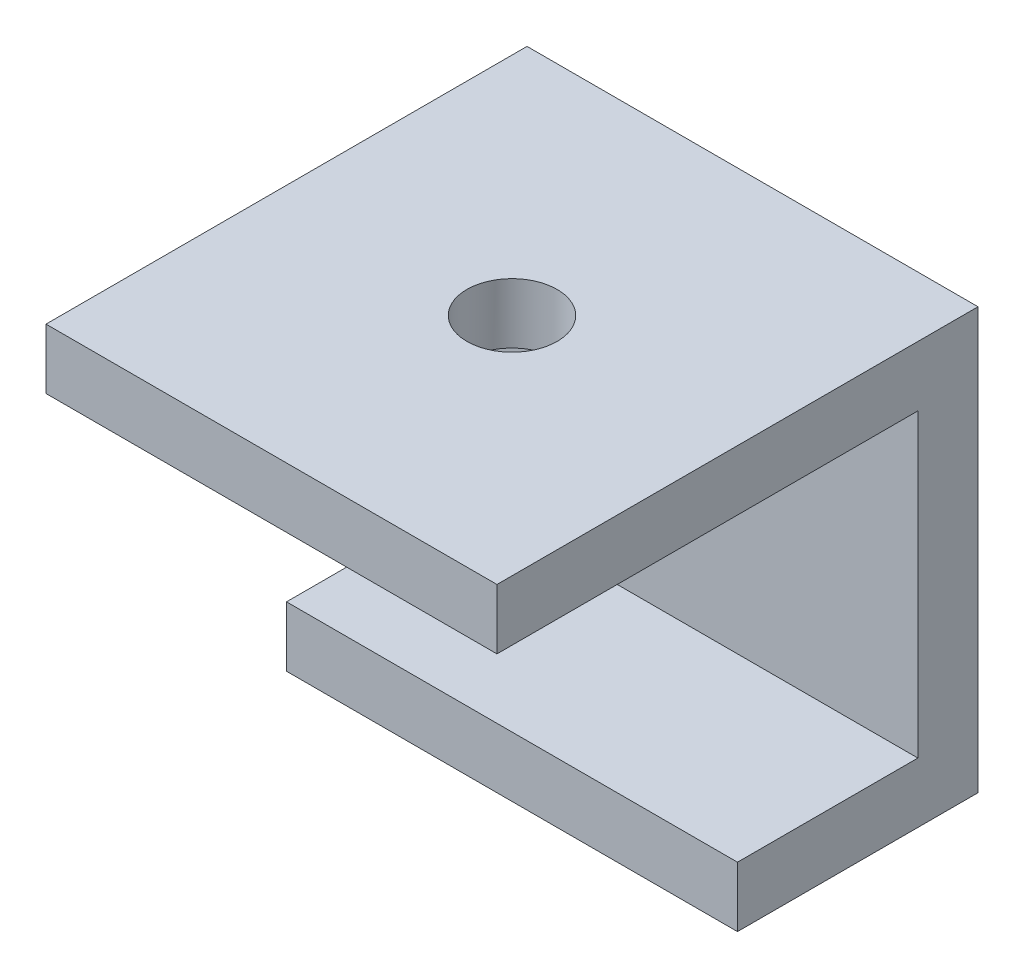
ISO-10303-21;
HEADER;
FILE_DESCRIPTION(('STEP AP214'),'2;1');
FILE_NAME('part.step','',(''),(''),'','','');
FILE_SCHEMA(('AUTOMOTIVE_DESIGN { 1 0 10303 214 1 1 1 1 }'));
ENDSEC;
DATA;
#1=APPLICATION_CONTEXT('core data for automotive mechanical design processes');
#2=APPLICATION_PROTOCOL_DEFINITION('international standard','automotive_design',2000,#1);
#3=PRODUCT_CONTEXT('',#1,'mechanical');
#4=PRODUCT('Part','Part','',(#3));
#5=PRODUCT_RELATED_PRODUCT_CATEGORY('part','',(#4));
#6=PRODUCT_DEFINITION_FORMATION('','',#4);
#7=PRODUCT_DEFINITION_CONTEXT('part definition',#1,'design');
#8=PRODUCT_DEFINITION('design','',#6,#7);
#9=PRODUCT_DEFINITION_SHAPE('','',#8);
#10=(LENGTH_UNIT() NAMED_UNIT(*) SI_UNIT(.MILLI.,.METRE.));
#11=(NAMED_UNIT(*) PLANE_ANGLE_UNIT() SI_UNIT($,.RADIAN.));
#12=(NAMED_UNIT(*) SI_UNIT($,.STERADIAN.) SOLID_ANGLE_UNIT());
#13=UNCERTAINTY_MEASURE_WITH_UNIT(LENGTH_MEASURE(1.E-05),#10,'distance_accuracy_value','');
#14=(GEOMETRIC_REPRESENTATION_CONTEXT(3) GLOBAL_UNCERTAINTY_ASSIGNED_CONTEXT((#13)) GLOBAL_UNIT_ASSIGNED_CONTEXT((#10,
#11,#12)) REPRESENTATION_CONTEXT('',''));
#15=CARTESIAN_POINT('',(0.,0.,0.));
#16=DIRECTION('',(0.,0.,1.));
#17=DIRECTION('',(1.,0.,0.));
#18=AXIS2_PLACEMENT_3D('',#15,#16,#17);
#19=CARTESIAN_POINT('',(-15.,0.,16.));
#20=DIRECTION('',(0.,1.,0.));
#21=DIRECTION('',(0.,0.,1.));
#22=AXIS2_PLACEMENT_3D('',#19,#20,#21);
#23=PLANE('',#22);
#24=CARTESIAN_POINT('',(-7.5,0.,8.));
#25=DIRECTION('',(0.,1.,0.));
#26=DIRECTION('',(0.,0.,1.));
#27=AXIS2_PLACEMENT_3D('',#24,#25,#26);
#28=CIRCLE('',#27,1.5);
#29=CARTESIAN_POINT('',(-7.5,0.,9.5));
#30=VERTEX_POINT('',#29);
#31=EDGE_CURVE('E134',#30,#30,#28,.T.);
#32=ORIENTED_EDGE('',*,*,#31,.F.);
#33=EDGE_LOOP('',(#32));
#34=FACE_BOUND('',#33,.T.);
#35=DIRECTION('',(0.,0.,1.));
#36=VECTOR('',#35,1.);
#37=CARTESIAN_POINT('',(0.,0.,16.));
#38=LINE('',#37,#36);
#39=CARTESIAN_POINT('',(0.,0.,0.));
#40=VERTEX_POINT('',#39);
#41=CARTESIAN_POINT('',(0.,0.,16.));
#42=VERTEX_POINT('',#41);
#43=EDGE_CURVE('E130',#40,#42,#38,.T.);
#44=ORIENTED_EDGE('',*,*,#43,.F.);
#45=DIRECTION('',(1.,0.,0.));
#46=VECTOR('',#45,1.);
#47=CARTESIAN_POINT('',(-15.,0.,0.));
#48=LINE('',#47,#46);
#49=CARTESIAN_POINT('',(-15.,0.,0.));
#50=VERTEX_POINT('',#49);
#51=EDGE_CURVE('E11',#50,#40,#48,.T.);
#52=ORIENTED_EDGE('',*,*,#51,.F.);
#53=DIRECTION('',(0.,0.,1.));
#54=VECTOR('',#53,1.);
#55=CARTESIAN_POINT('',(-15.,0.,16.));
#56=LINE('',#55,#54);
#57=CARTESIAN_POINT('',(-15.,0.,16.));
#58=VERTEX_POINT('',#57);
#59=EDGE_CURVE('E151',#50,#58,#56,.T.);
#60=ORIENTED_EDGE('',*,*,#59,.T.);
#61=DIRECTION('',(1.,0.,0.));
#62=VECTOR('',#61,1.);
#63=CARTESIAN_POINT('',(-15.,0.,16.));
#64=LINE('',#63,#62);
#65=EDGE_CURVE('E36',#58,#42,#64,.T.);
#66=ORIENTED_EDGE('',*,*,#65,.T.);
#67=EDGE_LOOP('',(#44,#52,#60,#66));
#68=FACE_BOUND('',#67,.T.);
#69=ADVANCED_FACE('F33',(#34,#68),#23,.T.);
#70=CARTESIAN_POINT('',(-15.,0.,0.));
#71=DIRECTION('',(0.,0.,-1.));
#72=DIRECTION('',(0.,1.,0.));
#73=AXIS2_PLACEMENT_3D('',#70,#71,#72);
#74=PLANE('',#73);
#75=DIRECTION('',(0.,1.,0.));
#76=VECTOR('',#75,1.);
#77=CARTESIAN_POINT('',(0.,0.,0.));
#78=LINE('',#77,#76);
#79=CARTESIAN_POINT('',(0.,-14.,0.));
#80=VERTEX_POINT('',#79);
#81=EDGE_CURVE('E149',#80,#40,#78,.T.);
#82=ORIENTED_EDGE('',*,*,#81,.F.);
#83=DIRECTION('',(1.,0.,0.));
#84=VECTOR('',#83,1.);
#85=CARTESIAN_POINT('',(-15.,-14.,0.));
#86=LINE('',#85,#84);
#87=CARTESIAN_POINT('',(-15.,-14.,0.));
#88=VERTEX_POINT('',#87);
#89=EDGE_CURVE('E42',#88,#80,#86,.T.);
#90=ORIENTED_EDGE('',*,*,#89,.F.);
#91=DIRECTION('',(0.,1.,0.));
#92=VECTOR('',#91,1.);
#93=CARTESIAN_POINT('',(-15.,0.,0.));
#94=LINE('',#93,#92);
#95=EDGE_CURVE('E120',#88,#50,#94,.T.);
#96=ORIENTED_EDGE('',*,*,#95,.T.);
#97=ORIENTED_EDGE('',*,*,#51,.T.);
#98=EDGE_LOOP('',(#82,#90,#96,#97));
#99=FACE_BOUND('',#98,.T.);
#100=ADVANCED_FACE('F163',(#99),#74,.T.);
#101=CARTESIAN_POINT('',(-15.,-14.,0.));
#102=DIRECTION('',(0.,-1.,0.));
#103=DIRECTION('',(0.,0.,-1.));
#104=AXIS2_PLACEMENT_3D('',#101,#102,#103);
#105=PLANE('',#104);
#106=DIRECTION('',(0.,0.,-1.));
#107=VECTOR('',#106,1.);
#108=CARTESIAN_POINT('',(0.,-14.,0.));
#109=LINE('',#108,#107);
#110=CARTESIAN_POINT('',(0.,-14.,8.));
#111=VERTEX_POINT('',#110);
#112=EDGE_CURVE('E107',#111,#80,#109,.T.);
#113=ORIENTED_EDGE('',*,*,#112,.F.);
#114=DIRECTION('',(1.,0.,0.));
#115=VECTOR('',#114,1.);
#116=CARTESIAN_POINT('',(-15.,-14.,8.));
#117=LINE('',#116,#115);
#118=CARTESIAN_POINT('',(-15.,-14.,8.));
#119=VERTEX_POINT('',#118);
#120=EDGE_CURVE('E102',#119,#111,#117,.T.);
#121=ORIENTED_EDGE('',*,*,#120,.F.);
#122=DIRECTION('',(0.,0.,-1.));
#123=VECTOR('',#122,1.);
#124=CARTESIAN_POINT('',(-15.,-14.,0.));
#125=LINE('',#124,#123);
#126=EDGE_CURVE('E105',#119,#88,#125,.T.);
#127=ORIENTED_EDGE('',*,*,#126,.T.);
#128=ORIENTED_EDGE('',*,*,#89,.T.);
#129=EDGE_LOOP('',(#113,#121,#127,#128));
#130=FACE_BOUND('',#129,.T.);
#131=ADVANCED_FACE('F104',(#130),#105,.T.);
#132=CARTESIAN_POINT('',(-15.,-14.,8.));
#133=DIRECTION('',(0.,0.,1.));
#134=DIRECTION('',(1.,0.,0.));
#135=AXIS2_PLACEMENT_3D('',#132,#133,#134);
#136=PLANE('',#135);
#137=DIRECTION('',(0.,-1.,0.));
#138=VECTOR('',#137,1.);
#139=CARTESIAN_POINT('',(0.,-14.,8.));
#140=LINE('',#139,#138);
#141=CARTESIAN_POINT('',(0.,-12.,8.));
#142=VERTEX_POINT('',#141);
#143=EDGE_CURVE('E146',#142,#111,#140,.T.);
#144=ORIENTED_EDGE('',*,*,#143,.F.);
#145=DIRECTION('',(1.,0.,0.));
#146=VECTOR('',#145,1.);
#147=CARTESIAN_POINT('',(-15.,-12.,8.));
#148=LINE('',#147,#146);
#149=CARTESIAN_POINT('',(-15.,-12.,8.));
#150=VERTEX_POINT('',#149);
#151=EDGE_CURVE('E112',#150,#142,#148,.T.);
#152=ORIENTED_EDGE('',*,*,#151,.F.);
#153=DIRECTION('',(0.,-1.,0.));
#154=VECTOR('',#153,1.);
#155=CARTESIAN_POINT('',(-15.,-14.,8.));
#156=LINE('',#155,#154);
#157=EDGE_CURVE('E118',#150,#119,#156,.T.);
#158=ORIENTED_EDGE('',*,*,#157,.T.);
#159=ORIENTED_EDGE('',*,*,#120,.T.);
#160=EDGE_LOOP('',(#144,#152,#158,#159));
#161=FACE_BOUND('',#160,.T.);
#162=ADVANCED_FACE('F122',(#161),#136,.T.);
#163=CARTESIAN_POINT('',(-15.,-12.,8.));
#164=DIRECTION('',(0.,1.,0.));
#165=DIRECTION('',(0.,0.,1.));
#166=AXIS2_PLACEMENT_3D('',#163,#164,#165);
#167=PLANE('',#166);
#168=DIRECTION('',(0.,0.,1.));
#169=VECTOR('',#168,1.);
#170=CARTESIAN_POINT('',(0.,-12.,8.));
#171=LINE('',#170,#169);
#172=CARTESIAN_POINT('',(0.,-12.,2.));
#173=VERTEX_POINT('',#172);
#174=EDGE_CURVE('E143',#173,#142,#171,.T.);
#175=ORIENTED_EDGE('',*,*,#174,.F.);
#176=DIRECTION('',(1.,0.,0.));
#177=VECTOR('',#176,1.);
#178=CARTESIAN_POINT('',(-15.,-12.,2.));
#179=LINE('',#178,#177);
#180=CARTESIAN_POINT('',(-15.,-12.,2.));
#181=VERTEX_POINT('',#180);
#182=EDGE_CURVE('E155',#181,#173,#179,.T.);
#183=ORIENTED_EDGE('',*,*,#182,.F.);
#184=DIRECTION('',(0.,0.,1.));
#185=VECTOR('',#184,1.);
#186=CARTESIAN_POINT('',(-15.,-12.,8.));
#187=LINE('',#186,#185);
#188=EDGE_CURVE('E123',#181,#150,#187,.T.);
#189=ORIENTED_EDGE('',*,*,#188,.T.);
#190=ORIENTED_EDGE('',*,*,#151,.T.);
#191=EDGE_LOOP('',(#175,#183,#189,#190));
#192=FACE_BOUND('',#191,.T.);
#193=ADVANCED_FACE('F177',(#192),#167,.T.);
#194=CARTESIAN_POINT('',(-15.,-12.,2.));
#195=DIRECTION('',(0.,0.,1.));
#196=DIRECTION('',(0.,-1.,0.));
#197=AXIS2_PLACEMENT_3D('',#194,#195,#196);
#198=PLANE('',#197);
#199=DIRECTION('',(0.,-1.,0.));
#200=VECTOR('',#199,1.);
#201=CARTESIAN_POINT('',(0.,-12.,2.));
#202=LINE('',#201,#200);
#203=CARTESIAN_POINT('',(0.,-2.,2.));
#204=VERTEX_POINT('',#203);
#205=EDGE_CURVE('E140',#204,#173,#202,.T.);
#206=ORIENTED_EDGE('',*,*,#205,.F.);
#207=DIRECTION('',(1.,0.,0.));
#208=VECTOR('',#207,1.);
#209=CARTESIAN_POINT('',(-15.,-2.,2.));
#210=LINE('',#209,#208);
#211=CARTESIAN_POINT('',(-15.,-2.,2.));
#212=VERTEX_POINT('',#211);
#213=EDGE_CURVE('E157',#212,#204,#210,.T.);
#214=ORIENTED_EDGE('',*,*,#213,.F.);
#215=DIRECTION('',(0.,-1.,0.));
#216=VECTOR('',#215,1.);
#217=CARTESIAN_POINT('',(-15.,-12.,2.));
#218=LINE('',#217,#216);
#219=EDGE_CURVE('E125',#212,#181,#218,.T.);
#220=ORIENTED_EDGE('',*,*,#219,.T.);
#221=ORIENTED_EDGE('',*,*,#182,.T.);
#222=EDGE_LOOP('',(#206,#214,#220,#221));
#223=FACE_BOUND('',#222,.T.);
#224=ADVANCED_FACE('F180',(#223),#198,.T.);
#225=CARTESIAN_POINT('',(-15.,-2.,2.));
#226=DIRECTION('',(0.,-1.,0.));
#227=DIRECTION('',(0.,0.,-1.));
#228=AXIS2_PLACEMENT_3D('',#225,#226,#227);
#229=PLANE('',#228);
#230=CARTESIAN_POINT('',(-7.5,-2.,8.));
#231=DIRECTION('',(0.,-1.,0.));
#232=DIRECTION('',(0.,0.,-1.));
#233=AXIS2_PLACEMENT_3D('',#230,#231,#232);
#234=CIRCLE('',#233,1.5);
#235=CARTESIAN_POINT('',(-7.5,-2.,6.5));
#236=VERTEX_POINT('',#235);
#237=EDGE_CURVE('E204',#236,#236,#234,.F.);
#238=ORIENTED_EDGE('',*,*,#237,.T.);
#239=EDGE_LOOP('',(#238));
#240=FACE_BOUND('',#239,.T.);
#241=DIRECTION('',(0.,0.,-1.));
#242=VECTOR('',#241,1.);
#243=CARTESIAN_POINT('',(0.,-2.,2.));
#244=LINE('',#243,#242);
#245=CARTESIAN_POINT('',(0.,-2.,16.));
#246=VERTEX_POINT('',#245);
#247=EDGE_CURVE('E137',#246,#204,#244,.T.);
#248=ORIENTED_EDGE('',*,*,#247,.F.);
#249=DIRECTION('',(1.,0.,0.));
#250=VECTOR('',#249,1.);
#251=CARTESIAN_POINT('',(-15.,-2.,16.));
#252=LINE('',#251,#250);
#253=CARTESIAN_POINT('',(-15.,-2.,16.));
#254=VERTEX_POINT('',#253);
#255=EDGE_CURVE('E158',#254,#246,#252,.T.);
#256=ORIENTED_EDGE('',*,*,#255,.F.);
#257=DIRECTION('',(0.,0.,-1.));
#258=VECTOR('',#257,1.);
#259=CARTESIAN_POINT('',(-15.,-2.,2.));
#260=LINE('',#259,#258);
#261=EDGE_CURVE('E213',#254,#212,#260,.T.);
#262=ORIENTED_EDGE('',*,*,#261,.T.);
#263=ORIENTED_EDGE('',*,*,#213,.T.);
#264=EDGE_LOOP('',(#248,#256,#262,#263));
#265=FACE_BOUND('',#264,.T.);
#266=ADVANCED_FACE('F184',(#240,#265),#229,.T.);
#267=CARTESIAN_POINT('',(-15.,-2.,16.));
#268=DIRECTION('',(0.,0.,1.));
#269=DIRECTION('',(1.,0.,0.));
#270=AXIS2_PLACEMENT_3D('',#267,#268,#269);
#271=PLANE('',#270);
#272=DIRECTION('',(0.,-1.,0.));
#273=VECTOR('',#272,1.);
#274=CARTESIAN_POINT('',(0.,-2.,16.));
#275=LINE('',#274,#273);
#276=EDGE_CURVE('E133',#42,#246,#275,.T.);
#277=ORIENTED_EDGE('',*,*,#276,.F.);
#278=ORIENTED_EDGE('',*,*,#65,.F.);
#279=DIRECTION('',(0.,-1.,0.));
#280=VECTOR('',#279,1.);
#281=CARTESIAN_POINT('',(-15.,-2.,16.));
#282=LINE('',#281,#280);
#283=EDGE_CURVE('E211',#58,#254,#282,.T.);
#284=ORIENTED_EDGE('',*,*,#283,.T.);
#285=ORIENTED_EDGE('',*,*,#255,.T.);
#286=EDGE_LOOP('',(#277,#278,#284,#285));
#287=FACE_BOUND('',#286,.T.);
#288=ADVANCED_FACE('F160',(#287),#271,.T.);
#289=CARTESIAN_POINT('',(-15.,0.,0.));
#290=DIRECTION('',(-1.,0.,0.));
#291=DIRECTION('',(0.,0.,1.));
#292=AXIS2_PLACEMENT_3D('',#289,#290,#291);
#293=PLANE('',#292);
#294=ORIENTED_EDGE('',*,*,#59,.F.);
#295=ORIENTED_EDGE('',*,*,#95,.F.);
#296=ORIENTED_EDGE('',*,*,#126,.F.);
#297=ORIENTED_EDGE('',*,*,#157,.F.);
#298=ORIENTED_EDGE('',*,*,#188,.F.);
#299=ORIENTED_EDGE('',*,*,#219,.F.);
#300=ORIENTED_EDGE('',*,*,#261,.F.);
#301=ORIENTED_EDGE('',*,*,#283,.F.);
#302=EDGE_LOOP('',(#294,#295,#296,#297,#298,#299,#300,#301));
#303=FACE_BOUND('',#302,.T.);
#304=ADVANCED_FACE('F116',(#303),#293,.T.);
#305=CARTESIAN_POINT('',(0.,0.,0.));
#306=DIRECTION('',(-1.,0.,0.));
#307=DIRECTION('',(0.,0.,1.));
#308=AXIS2_PLACEMENT_3D('',#305,#306,#307);
#309=PLANE('',#308);
#310=ORIENTED_EDGE('',*,*,#43,.T.);
#311=ORIENTED_EDGE('',*,*,#276,.T.);
#312=ORIENTED_EDGE('',*,*,#247,.T.);
#313=ORIENTED_EDGE('',*,*,#205,.T.);
#314=ORIENTED_EDGE('',*,*,#174,.T.);
#315=ORIENTED_EDGE('',*,*,#143,.T.);
#316=ORIENTED_EDGE('',*,*,#112,.T.);
#317=ORIENTED_EDGE('',*,*,#81,.T.);
#318=EDGE_LOOP('',(#310,#311,#312,#313,#314,#315,#316,#317));
#319=FACE_BOUND('',#318,.T.);
#320=ADVANCED_FACE('F162',(#319),#309,.F.);
#321=CARTESIAN_POINT('',(-7.5,-14.001,8.));
#322=DIRECTION('',(0.,1.,0.));
#323=DIRECTION('',(0.,0.,1.));
#324=AXIS2_PLACEMENT_3D('',#321,#322,#323);
#325=CYLINDRICAL_SURFACE('',#324,1.5);
#326=ORIENTED_EDGE('',*,*,#237,.F.);
#327=EDGE_LOOP('',(#326));
#328=FACE_BOUND('',#327,.T.);
#329=ORIENTED_EDGE('',*,*,#31,.T.);
#330=EDGE_LOOP('',(#329));
#331=FACE_BOUND('',#330,.T.);
#332=ADVANCED_FACE('F195',(#328,#331),#325,.F.);
#333=CLOSED_SHELL('',(#69,#100,#131,#162,#193,#224,#266,#288,#304,#320,#332));
#334=MANIFOLD_SOLID_BREP('B2',#333);
#335=ADVANCED_BREP_SHAPE_REPRESENTATION('',(#18,#334),#14);
#336=SHAPE_DEFINITION_REPRESENTATION(#9,#335);
ENDSEC;
END-ISO-10303-21;
